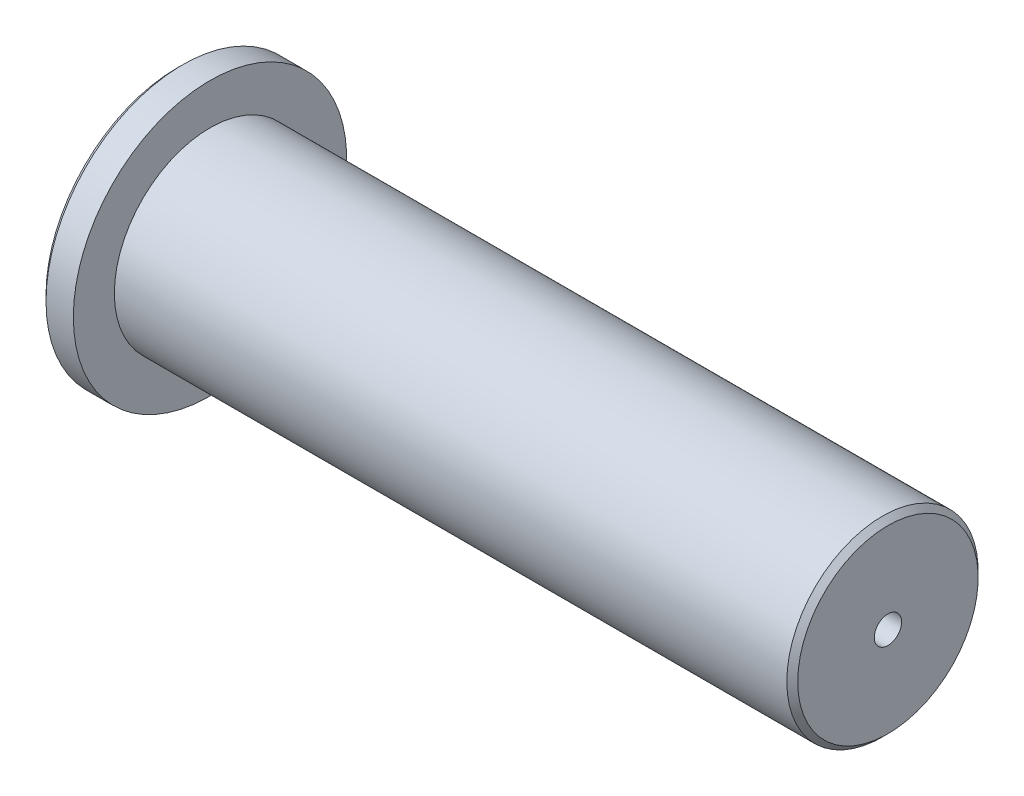
ISO-10303-21;
HEADER;
FILE_DESCRIPTION(('STEP AP214'),'2;1');
FILE_NAME('part.step','',(''),(''),'','','');
FILE_SCHEMA(('AUTOMOTIVE_DESIGN { 1 0 10303 214 1 1 1 1 }'));
ENDSEC;
DATA;
#1=APPLICATION_CONTEXT('core data for automotive mechanical design processes');
#2=APPLICATION_PROTOCOL_DEFINITION('international standard','automotive_design',2000,#1);
#3=PRODUCT_CONTEXT('',#1,'mechanical');
#4=PRODUCT('Part','Part','',(#3));
#5=PRODUCT_RELATED_PRODUCT_CATEGORY('part','',(#4));
#6=PRODUCT_DEFINITION_FORMATION('','',#4);
#7=PRODUCT_DEFINITION_CONTEXT('part definition',#1,'design');
#8=PRODUCT_DEFINITION('design','',#6,#7);
#9=PRODUCT_DEFINITION_SHAPE('','',#8);
#10=(LENGTH_UNIT() NAMED_UNIT(*) SI_UNIT(.MILLI.,.METRE.));
#11=(NAMED_UNIT(*) PLANE_ANGLE_UNIT() SI_UNIT($,.RADIAN.));
#12=(NAMED_UNIT(*) SI_UNIT($,.STERADIAN.) SOLID_ANGLE_UNIT());
#13=UNCERTAINTY_MEASURE_WITH_UNIT(LENGTH_MEASURE(1.E-05),#10,'distance_accuracy_value','');
#14=(GEOMETRIC_REPRESENTATION_CONTEXT(3) GLOBAL_UNCERTAINTY_ASSIGNED_CONTEXT((#13)) GLOBAL_UNIT_ASSIGNED_CONTEXT((#10,
#11,#12)) REPRESENTATION_CONTEXT('',''));
#15=CARTESIAN_POINT('',(0.,0.,0.));
#16=DIRECTION('',(0.,0.,1.));
#17=DIRECTION('',(1.,0.,0.));
#18=AXIS2_PLACEMENT_3D('',#15,#16,#17);
#19=CARTESIAN_POINT('',(-4230.17838032797,-7396.48323822232,0.));
#20=DIRECTION('',(-1.,0.,0.));
#21=DIRECTION('',(0.,0.,1.));
#22=AXIS2_PLACEMENT_3D('',#19,#20,#21);
#23=PLANE('',#22);
#24=CARTESIAN_POINT('',(-4230.17838032797,-7413.98323822232,0.));
#25=DIRECTION('',(-1.,0.,0.));
#26=DIRECTION('',(0.,0.,1.));
#27=AXIS2_PLACEMENT_3D('',#24,#25,#26);
#28=CIRCLE('',#27,25.0000000000004);
#29=CARTESIAN_POINT('',(-4230.17838032797,-7413.98323822232,25.0000000000004));
#30=VERTEX_POINT('',#29);
#31=EDGE_CURVE('E11',#30,#30,#28,.T.);
#32=ORIENTED_EDGE('',*,*,#31,.F.);
#33=EDGE_LOOP('',(#32));
#34=FACE_BOUND('',#33,.T.);
#35=CARTESIAN_POINT('',(-4230.17838032797,-7413.98323822232,0.));
#36=DIRECTION('',(-1.,0.,0.));
#37=DIRECTION('',(0.,0.,1.));
#38=AXIS2_PLACEMENT_3D('',#35,#36,#37);
#39=CIRCLE('',#38,17.5000000000001);
#40=CARTESIAN_POINT('',(-4230.17838032797,-7413.98323822232,17.5000000000001));
#41=VERTEX_POINT('',#40);
#42=EDGE_CURVE('E53',#41,#41,#39,.T.);
#43=ORIENTED_EDGE('',*,*,#42,.T.);
#44=EDGE_LOOP('',(#43));
#45=FACE_BOUND('',#44,.T.);
#46=ADVANCED_FACE('F34',(#34,#45),#23,.F.);
#47=CARTESIAN_POINT('',(-4215.7186258757,-7413.98323822232,0.));
#48=DIRECTION('',(-1.,0.,0.));
#49=DIRECTION('',(0.,0.,1.));
#50=AXIS2_PLACEMENT_3D('',#47,#48,#49);
#51=CYLINDRICAL_SURFACE('',#50,25.0000000000004);
#52=CARTESIAN_POINT('',(-4235.17838032797,-7413.98323822232,0.));
#53=DIRECTION('',(-1.,0.,0.));
#54=DIRECTION('',(0.,0.,1.));
#55=AXIS2_PLACEMENT_3D('',#52,#53,#54);
#56=CIRCLE('',#55,25.0000000000004);
#57=CARTESIAN_POINT('',(-4235.17838032797,-7413.98323822232,25.0000000000004));
#58=VERTEX_POINT('',#57);
#59=EDGE_CURVE('E40',#58,#58,#56,.T.);
#60=ORIENTED_EDGE('',*,*,#59,.F.);
#61=EDGE_LOOP('',(#60));
#62=FACE_BOUND('',#61,.T.);
#63=ORIENTED_EDGE('',*,*,#31,.T.);
#64=EDGE_LOOP('',(#63));
#65=FACE_BOUND('',#64,.T.);
#66=ADVANCED_FACE('F74',(#62,#65),#51,.T.);
#67=CARTESIAN_POINT('',(-4235.17838032797,-7413.98323822232,0.));
#68=DIRECTION('',(1.,0.,0.));
#69=DIRECTION('',(0.,0.,-1.));
#70=AXIS2_PLACEMENT_3D('',#67,#68,#69);
#71=CONICAL_SURFACE('',#70,25.0000000000004,0.785398163397448);
#72=CARTESIAN_POINT('',(-4236.17838032797,-7413.98323822232,0.));
#73=DIRECTION('',(-1.,0.,0.));
#74=DIRECTION('',(0.,0.,1.));
#75=AXIS2_PLACEMENT_3D('',#72,#73,#74);
#76=CIRCLE('',#75,24.);
#77=CARTESIAN_POINT('',(-4236.17838032797,-7413.98323822232,24.));
#78=VERTEX_POINT('',#77);
#79=EDGE_CURVE('E67',#78,#78,#76,.T.);
#80=ORIENTED_EDGE('',*,*,#79,.F.);
#81=EDGE_LOOP('',(#80));
#82=FACE_BOUND('',#81,.T.);
#83=ORIENTED_EDGE('',*,*,#59,.T.);
#84=EDGE_LOOP('',(#83));
#85=FACE_BOUND('',#84,.T.);
#86=ADVANCED_FACE('F72',(#82,#85),#71,.T.);
#87=CARTESIAN_POINT('',(-4236.17838032797,-7413.98323822232,0.));
#88=DIRECTION('',(1.,0.,0.));
#89=DIRECTION('',(0.,0.,-1.));
#90=AXIS2_PLACEMENT_3D('',#87,#88,#89);
#91=PLANE('',#90);
#92=ORIENTED_EDGE('',*,*,#79,.T.);
#93=EDGE_LOOP('',(#92));
#94=FACE_BOUND('',#93,.T.);
#95=ADVANCED_FACE('F96',(#94),#91,.F.);
#96=CARTESIAN_POINT('',(-4106.17838032797,-7397.48323822232,0.));
#97=DIRECTION('',(-1.,0.,0.));
#98=DIRECTION('',(0.,0.,1.));
#99=AXIS2_PLACEMENT_3D('',#96,#97,#98);
#100=PLANE('',#99);
#101=CARTESIAN_POINT('',(-4106.17838032797,-7413.98323822232,0.));
#102=DIRECTION('',(1.,0.,0.));
#103=DIRECTION('',(0.,0.,-1.));
#104=AXIS2_PLACEMENT_3D('',#101,#102,#103);
#105=CIRCLE('',#104,2.50000000000039);
#106=CARTESIAN_POINT('',(-4106.17838032797,-7413.98323822232,-2.50000000000039));
#107=VERTEX_POINT('',#106);
#108=EDGE_CURVE('E54',#107,#107,#105,.T.);
#109=ORIENTED_EDGE('',*,*,#108,.F.);
#110=EDGE_LOOP('',(#109));
#111=FACE_BOUND('',#110,.T.);
#112=CARTESIAN_POINT('',(-4106.17838032797,-7413.98323822232,0.));
#113=DIRECTION('',(-1.,0.,0.));
#114=DIRECTION('',(0.,0.,1.));
#115=AXIS2_PLACEMENT_3D('',#112,#113,#114);
#116=CIRCLE('',#115,16.4999999999997);
#117=CARTESIAN_POINT('',(-4106.17838032797,-7413.98323822232,16.4999999999997));
#118=VERTEX_POINT('',#117);
#119=EDGE_CURVE('E64',#118,#118,#116,.T.);
#120=ORIENTED_EDGE('',*,*,#119,.F.);
#121=EDGE_LOOP('',(#120));
#122=FACE_BOUND('',#121,.T.);
#123=ADVANCED_FACE('F91',(#111,#122),#100,.F.);
#124=CARTESIAN_POINT('',(-4106.17838032797,-7413.98323822232,0.));
#125=DIRECTION('',(-1.,0.,0.));
#126=DIRECTION('',(0.,0.,1.));
#127=AXIS2_PLACEMENT_3D('',#124,#125,#126);
#128=CONICAL_SURFACE('',#127,16.4999999999997,0.785398163397448);
#129=CARTESIAN_POINT('',(-4107.17838032797,-7413.98323822232,0.));
#130=DIRECTION('',(-1.,0.,0.));
#131=DIRECTION('',(0.,0.,1.));
#132=AXIS2_PLACEMENT_3D('',#129,#130,#131);
#133=CIRCLE('',#132,17.5000000000001);
#134=CARTESIAN_POINT('',(-4107.17838032797,-7413.98323822232,17.5000000000001));
#135=VERTEX_POINT('',#134);
#136=EDGE_CURVE('E57',#135,#135,#133,.T.);
#137=ORIENTED_EDGE('',*,*,#136,.F.);
#138=EDGE_LOOP('',(#137));
#139=FACE_BOUND('',#138,.T.);
#140=ORIENTED_EDGE('',*,*,#119,.T.);
#141=EDGE_LOOP('',(#140));
#142=FACE_BOUND('',#141,.T.);
#143=ADVANCED_FACE('F85',(#139,#142),#128,.T.);
#144=CARTESIAN_POINT('',(-4215.7186258757,-7413.98323822232,0.));
#145=DIRECTION('',(-1.,0.,0.));
#146=DIRECTION('',(0.,0.,1.));
#147=AXIS2_PLACEMENT_3D('',#144,#145,#146);
#148=CYLINDRICAL_SURFACE('',#147,17.5000000000001);
#149=ORIENTED_EDGE('',*,*,#42,.F.);
#150=EDGE_LOOP('',(#149));
#151=FACE_BOUND('',#150,.T.);
#152=ORIENTED_EDGE('',*,*,#136,.T.);
#153=EDGE_LOOP('',(#152));
#154=FACE_BOUND('',#153,.T.);
#155=ADVANCED_FACE('F47',(#151,#154),#148,.T.);
#156=CARTESIAN_POINT('',(-4121.17838032797,-7413.98323822232,0.));
#157=DIRECTION('',(1.,0.,0.));
#158=DIRECTION('',(0.,0.,-1.));
#159=AXIS2_PLACEMENT_3D('',#156,#157,#158);
#160=CONICAL_SURFACE('',#159,2.50000000000039,1.02974425867655);
#161=CARTESIAN_POINT('',(-4122.68053187554,-7413.98323822232,0.));
#162=VERTEX_POINT('',#161);
#163=VERTEX_LOOP('',#162);
#164=FACE_BOUND('',#163,.T.);
#165=CARTESIAN_POINT('',(-4121.17838032797,-7413.98323822232,0.));
#166=DIRECTION('',(1.,0.,0.));
#167=DIRECTION('',(0.,0.,-1.));
#168=AXIS2_PLACEMENT_3D('',#165,#166,#167);
#169=CIRCLE('',#168,2.50000000000039);
#170=CARTESIAN_POINT('',(-4121.17838032797,-7413.98323822232,-2.50000000000039));
#171=VERTEX_POINT('',#170);
#172=EDGE_CURVE('E51',#171,#171,#169,.T.);
#173=ORIENTED_EDGE('',*,*,#172,.T.);
#174=EDGE_LOOP('',(#173));
#175=FACE_BOUND('',#174,.T.);
#176=ADVANCED_FACE('F43',(#164,#175),#160,.F.);
#177=CARTESIAN_POINT('',(-4106.17838032797,-7413.98323822232,0.));
#178=DIRECTION('',(1.,0.,0.));
#179=DIRECTION('',(0.,0.,-1.));
#180=AXIS2_PLACEMENT_3D('',#177,#178,#179);
#181=CYLINDRICAL_SURFACE('',#180,2.50000000000039);
#182=ORIENTED_EDGE('',*,*,#172,.F.);
#183=EDGE_LOOP('',(#182));
#184=FACE_BOUND('',#183,.T.);
#185=ORIENTED_EDGE('',*,*,#108,.T.);
#186=EDGE_LOOP('',(#185));
#187=FACE_BOUND('',#186,.T.);
#188=ADVANCED_FACE('F46',(#184,#187),#181,.F.);
#189=CLOSED_SHELL('',(#46,#66,#86,#95,#123,#143,#155,#176,#188));
#190=MANIFOLD_SOLID_BREP('B2',#189);
#191=ADVANCED_BREP_SHAPE_REPRESENTATION('',(#18,#190),#14);
#192=SHAPE_DEFINITION_REPRESENTATION(#9,#191);
ENDSEC;
END-ISO-10303-21;
